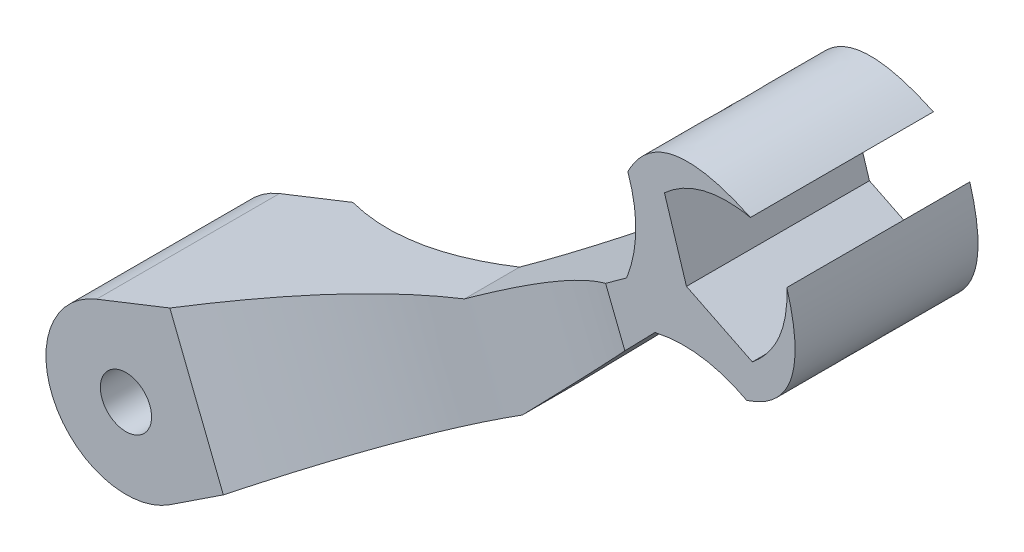
ISO-10303-21;
HEADER;
FILE_DESCRIPTION(('STEP AP214'),'2;1');
FILE_NAME('part.step','',(''),(''),'','','');
FILE_SCHEMA(('AUTOMOTIVE_DESIGN { 1 0 10303 214 1 1 1 1 }'));
ENDSEC;
DATA;
#1=APPLICATION_CONTEXT('core data for automotive mechanical design processes');
#2=APPLICATION_PROTOCOL_DEFINITION('international standard','automotive_design',2000,#1);
#3=PRODUCT_CONTEXT('',#1,'mechanical');
#4=PRODUCT('Part','Part','',(#3));
#5=PRODUCT_RELATED_PRODUCT_CATEGORY('part','',(#4));
#6=PRODUCT_DEFINITION_FORMATION('','',#4);
#7=PRODUCT_DEFINITION_CONTEXT('part definition',#1,'design');
#8=PRODUCT_DEFINITION('design','',#6,#7);
#9=PRODUCT_DEFINITION_SHAPE('','',#8);
#10=(LENGTH_UNIT() NAMED_UNIT(*) SI_UNIT(.MILLI.,.METRE.));
#11=(NAMED_UNIT(*) PLANE_ANGLE_UNIT() SI_UNIT($,.RADIAN.));
#12=(NAMED_UNIT(*) SI_UNIT($,.STERADIAN.) SOLID_ANGLE_UNIT());
#13=UNCERTAINTY_MEASURE_WITH_UNIT(LENGTH_MEASURE(1.E-05),#10,'distance_accuracy_value','');
#14=(GEOMETRIC_REPRESENTATION_CONTEXT(3) GLOBAL_UNCERTAINTY_ASSIGNED_CONTEXT((#13)) GLOBAL_UNIT_ASSIGNED_CONTEXT((#10,
#11,#12)) REPRESENTATION_CONTEXT('',''));
#15=CARTESIAN_POINT('',(0.,0.,0.));
#16=DIRECTION('',(0.,0.,1.));
#17=DIRECTION('',(1.,0.,0.));
#18=AXIS2_PLACEMENT_3D('',#15,#16,#17);
#19=CARTESIAN_POINT('',(0.,0.,20.32));
#20=DIRECTION('',(0.,0.,1.));
#21=DIRECTION('',(1.,0.,0.));
#22=AXIS2_PLACEMENT_3D('',#19,#20,#21);
#23=PLANE('',#22);
#24=DIRECTION('',(-0.810919763460068,-0.585157361083211,0.));
#25=VECTOR('',#24,1.);
#26=CARTESIAN_POINT('',(60.9907873534478,43.2497564408883,20.32));
#27=LINE('',#26,#25);
#28=CARTESIAN_POINT('',(111.21965607316,79.4947631537742,20.32));
#29=VERTEX_POINT('',#28);
#30=CARTESIAN_POINT('',(106.54054712,76.1183316365923,20.32));
#31=VERTEX_POINT('',#30);
#32=EDGE_CURVE('E371',#29,#31,#27,.T.);
#33=ORIENTED_EDGE('',*,*,#32,.T.);
#34=DIRECTION('',(0.367873620684487,-0.929875797730259,0.));
#35=VECTOR('',#34,1.);
#36=CARTESIAN_POINT('',(80.3174624117796,142.402540236909,20.32));
#37=LINE('',#36,#35);
#38=CARTESIAN_POINT('',(110.824263645709,65.2903621991998,20.32));
#39=VERTEX_POINT('',#38);
#40=EDGE_CURVE('E258',#31,#39,#37,.T.);
#41=ORIENTED_EDGE('',*,*,#40,.T.);
#42=DIRECTION('',(0.69778723962863,0.716305080403216,0.));
#43=VECTOR('',#42,1.);
#44=CARTESIAN_POINT('',(74.0328425107888,27.5225722805653,20.32));
#45=LINE('',#44,#43);
#46=CARTESIAN_POINT('',(117.511141846048,72.1546964187383,20.32));
#47=VERTEX_POINT('',#46);
#48=EDGE_CURVE('E205',#39,#47,#45,.T.);
#49=ORIENTED_EDGE('',*,*,#48,.T.);
#50=CARTESIAN_POINT('',(117.511141846048,72.1546964187383,20.32));
#51=CARTESIAN_POINT('',(128.03696367341,74.4965693206494,20.32));
#52=CARTESIAN_POINT('',(137.894611709155,69.2688063883033,20.32));
#53=B_SPLINE_CURVE_WITH_KNOTS('',2,(#50,#51,#52),.UNSPECIFIED.,.F.,.F.,(3,3),(0.,1.),.UNSPECIFIED.);
#54=CARTESIAN_POINT('',(137.894611709155,69.2688063883033,20.32));
#55=VERTEX_POINT('',#54);
#56=EDGE_CURVE('E208',#47,#55,#53,.T.);
#57=ORIENTED_EDGE('',*,*,#56,.T.);
#58=CARTESIAN_POINT('',(137.894611709155,69.2688063883033,20.32));
#59=CARTESIAN_POINT('',(153.056423627428,74.1893946725533,20.32));
#60=CARTESIAN_POINT('',(146.802069803913,95.4454043846387,20.32));
#61=B_SPLINE_CURVE_WITH_KNOTS('',2,(#58,#59,#60),.UNSPECIFIED.,.F.,.F.,(3,3),(0.,1.),.UNSPECIFIED.);
#62=CARTESIAN_POINT('',(146.802069803913,95.4454043846387,20.32));
#63=VERTEX_POINT('',#62);
#64=EDGE_CURVE('E214',#55,#63,#61,.T.);
#65=ORIENTED_EDGE('',*,*,#64,.T.);
#66=CARTESIAN_POINT('',(146.802069803913,95.4454043846387,20.32));
#67=CARTESIAN_POINT('',(147.308308441574,83.9811498959264,20.32));
#68=CARTESIAN_POINT('',(139.137891823467,77.3023086653942,20.32));
#69=B_SPLINE_CURVE_WITH_KNOTS('',2,(#66,#67,#68),.UNSPECIFIED.,.F.,.F.,(3,3),(0.,1.),.UNSPECIFIED.);
#70=CARTESIAN_POINT('',(139.137891823467,77.3023086653942,20.32));
#71=VERTEX_POINT('',#70);
#72=EDGE_CURVE('E415',#63,#71,#69,.T.);
#73=ORIENTED_EDGE('',*,*,#72,.T.);
#74=CARTESIAN_POINT('',(139.137891823467,77.3023086653942,20.32));
#75=CARTESIAN_POINT('',(124.506668385523,84.5172464370435,20.32));
#76=B_SPLINE_CURVE_WITH_KNOTS('',1,(#74,#75),.UNSPECIFIED.,.F.,.F.,(2,2),(0.,1.),.UNSPECIFIED.);
#77=CARTESIAN_POINT('',(124.506668385523,84.5172464370435,20.32));
#78=VERTEX_POINT('',#77);
#79=EDGE_CURVE('E421',#71,#78,#76,.T.);
#80=ORIENTED_EDGE('',*,*,#79,.T.);
#81=CARTESIAN_POINT('',(124.506668385523,84.5172464370435,20.32));
#82=CARTESIAN_POINT('',(119.61432876052,100.079798905499,20.32));
#83=B_SPLINE_CURVE_WITH_KNOTS('',1,(#81,#82),.UNSPECIFIED.,.F.,.F.,(2,2),(0.,1.),.UNSPECIFIED.);
#84=CARTESIAN_POINT('',(119.61432876052,100.079798905499,20.32));
#85=VERTEX_POINT('',#84);
#86=EDGE_CURVE('E428',#78,#85,#83,.T.);
#87=ORIENTED_EDGE('',*,*,#86,.T.);
#88=CARTESIAN_POINT('',(119.61432876052,100.079798905499,20.32));
#89=CARTESIAN_POINT('',(127.464188518168,107.1326231399,20.32));
#90=CARTESIAN_POINT('',(138.716144691841,104.878983682056,20.32));
#91=B_SPLINE_CURVE_WITH_KNOTS('',2,(#88,#89,#90),.UNSPECIFIED.,.F.,.F.,(3,3),(0.,1.),.UNSPECIFIED.);
#92=CARTESIAN_POINT('',(138.716144691841,104.878983682056,20.32));
#93=VERTEX_POINT('',#92);
#94=EDGE_CURVE('E389',#85,#93,#91,.T.);
#95=ORIENTED_EDGE('',*,*,#94,.T.);
#96=CARTESIAN_POINT('',(138.716144691841,104.878983682056,20.32));
#97=CARTESIAN_POINT('',(118.666753914083,114.31067600479,20.32));
#98=CARTESIAN_POINT('',(111.485189551559,100.079798905499,20.32));
#99=B_SPLINE_CURVE_WITH_KNOTS('',2,(#96,#97,#98),.UNSPECIFIED.,.F.,.F.,(3,3),(0.,1.),.UNSPECIFIED.);
#100=CARTESIAN_POINT('',(111.485189551559,100.079798905499,20.32));
#101=VERTEX_POINT('',#100);
#102=EDGE_CURVE('E380',#93,#101,#99,.T.);
#103=ORIENTED_EDGE('',*,*,#102,.T.);
#104=CARTESIAN_POINT('',(111.485189551559,100.079798905499,20.32));
#105=CARTESIAN_POINT('',(115.143809102763,89.5385829864038,20.32));
#106=CARTESIAN_POINT('',(111.21965607316,79.4947631537742,20.32));
#107=B_SPLINE_CURVE_WITH_KNOTS('',2,(#104,#105,#106),.UNSPECIFIED.,.F.,.F.,(3,3),(0.,1.),.UNSPECIFIED.);
#108=EDGE_CURVE('E374',#101,#29,#107,.T.);
#109=ORIENTED_EDGE('',*,*,#108,.T.);
#110=EDGE_LOOP('',(#33,#41,#49,#57,#65,#73,#80,#87,#95,#103,#109));
#111=FACE_BOUND('',#110,.T.);
#112=ADVANCED_FACE('F43',(#111),#23,.T.);
#113=DIRECTION('',(0.834822778271186,0.550518781586586,0.));
#114=VECTOR('',#113,1.);
#115=CARTESIAN_POINT('',(9.78822393660949,-14.8431489976617,20.32));
#116=LINE('',#115,#114);
#117=CARTESIAN_POINT('',(9.78822393660949,-14.8431489976617,20.32));
#118=VERTEX_POINT('',#117);
#119=CARTESIAN_POINT('',(21.6261436223229,-7.03670517326739,20.32));
#120=VERTEX_POINT('',#119);
#121=EDGE_CURVE('E195',#118,#120,#116,.T.);
#122=ORIENTED_EDGE('',*,*,#121,.T.);
#123=DIRECTION('',(0.367873620684487,-0.929875797730259,0.));
#124=VECTOR('',#123,1.);
#125=CARTESIAN_POINT('',(-21.5507968200842,102.101840457516,20.32));
#126=LINE('',#125,#124);
#127=CARTESIAN_POINT('',(9.75156956395877,22.9787088286477,20.32));
#128=VERTEX_POINT('',#127);
#129=EDGE_CURVE('E282',#128,#120,#126,.T.);
#130=ORIENTED_EDGE('',*,*,#129,.F.);
#131=DIRECTION('',(-0.929875797730259,-0.367873620684486,0.));
#132=VECTOR('',#131,1.);
#133=CARTESIAN_POINT('',(-6.54079297577017,16.533191683644,20.32));
#134=LINE('',#133,#132);
#135=CARTESIAN_POINT('',(-6.54079297577017,16.533191683644,20.32));
#136=VERTEX_POINT('',#135);
#137=EDGE_CURVE('E368',#128,#136,#134,.T.);
#138=ORIENTED_EDGE('',*,*,#137,.T.);
#139=CARTESIAN_POINT('',(0.,0.,20.32));
#140=DIRECTION('',(0.,0.,1.));
#141=DIRECTION('',(1.,0.,0.));
#142=AXIS2_PLACEMENT_3D('',#139,#140,#141);
#143=CIRCLE('',#142,17.78);
#144=EDGE_CURVE('E189',#136,#118,#143,.T.);
#145=ORIENTED_EDGE('',*,*,#144,.T.);
#146=EDGE_LOOP('',(#122,#130,#138,#145));
#147=FACE_BOUND('',#146,.T.);
#148=CARTESIAN_POINT('',(0.,0.,20.32));
#149=DIRECTION('',(0.,0.,1.));
#150=DIRECTION('',(1.,0.,0.));
#151=AXIS2_PLACEMENT_3D('',#148,#149,#150);
#152=CIRCLE('',#151,5.69013005613397);
#153=CARTESIAN_POINT('',(5.69013005613397,0.,20.32));
#154=VERTEX_POINT('',#153);
#155=EDGE_CURVE('E564',#154,#154,#152,.T.);
#156=ORIENTED_EDGE('',*,*,#155,.F.);
#157=EDGE_LOOP('',(#156));
#158=FACE_BOUND('',#157,.T.);
#159=ADVANCED_FACE('F551',(#147,#158),#23,.T.);
#160=CARTESIAN_POINT('',(9.78822393660949,-14.8431489976617,20.32));
#161=DIRECTION('',(-0.550518781586586,0.834822778271186,0.));
#162=DIRECTION('',(-0.834822778271186,-0.550518781586586,0.));
#163=AXIS2_PLACEMENT_3D('',#160,#161,#162);
#164=PLANE('',#163);
#165=CARTESIAN_POINT('',(74.0328425107888,27.5225722805653,-6.31627004977947));
#166=CARTESIAN_POINT('',(73.464788712993,27.1479726735854,-6.27579137342487));
#167=CARTESIAN_POINT('',(72.8964351492953,26.7731753878128,-6.24161365913269));
#168=CARTESIAN_POINT('',(71.7592970210883,26.023296595415,-6.18588283049014));
#169=CARTESIAN_POINT('',(71.1905124567089,25.6482150888756,-6.16432971233445));
#170=CARTESIAN_POINT('',(69.4845804903926,24.5232486744338,-6.11866307716634));
#171=CARTESIAN_POINT('',(68.3470396233367,23.7731042983622,-6.11348417250185));
#172=CARTESIAN_POINT('',(66.0731069181015,22.2735732662929,-6.1535686233571));
#173=CARTESIAN_POINT('',(64.9367147948052,21.5241864222765,-6.19880986202309));
#174=CARTESIAN_POINT('',(62.6663336723458,20.0269974597737,-6.33932979763939));
#175=CARTESIAN_POINT('',(61.5323442034024,19.2791950314936,-6.43459758676275));
#176=CARTESIAN_POINT('',(59.2680597372363,17.7860264717417,-6.67454703559294));
#177=CARTESIAN_POINT('',(58.1377646177394,17.040660259637,-6.81922704280519));
#178=CARTESIAN_POINT('',(55.9053630154764,15.5685166597285,-7.15367869291013));
#179=CARTESIAN_POINT('',(54.8031534922309,14.84167132251,-7.34246566157905));
#180=CARTESIAN_POINT('',(52.6047808911212,13.3919679395447,-7.76562500244627));
#181=CARTESIAN_POINT('',(51.5086182281109,12.6691101673708,-8.00000046327809));
#182=CARTESIAN_POINT('',(49.3235242035605,11.2281632606048,-8.51314779221155));
#183=CARTESIAN_POINT('',(48.2345931245149,10.510074312302,-8.79192138417765));
#184=CARTESIAN_POINT('',(46.0651174648114,9.07942684082909,-9.39249795540599));
#185=CARTESIAN_POINT('',(44.9845723610929,8.36686797272971,-9.71429822775677));
#186=CARTESIAN_POINT('',(42.8329804016233,6.94801379813279,-10.3994012788384));
#187=CARTESIAN_POINT('',(41.7619312479956,6.24171697631453,-10.762693704387));
#188=CARTESIAN_POINT('',(39.8798646612682,5.00059966236715,-11.4394041132547));
#189=CARTESIAN_POINT('',(39.0667625130823,4.46440441760908,-11.7445423688031));
#190=CARTESIAN_POINT('',(37.4469115303607,3.39620358197009,-12.3774830062166));
#191=CARTESIAN_POINT('',(36.6401614259768,2.86419715369556,-12.705280723095));
#192=CARTESIAN_POINT('',(35.0331951579745,1.8044930644715,-13.382830813308));
#193=CARTESIAN_POINT('',(34.2329784440151,1.27679504060299,-13.7325813154281));
#194=CARTESIAN_POINT('',(32.6392464746479,0.225818228771651,-14.4533183608676));
#195=CARTESIAN_POINT('',(31.8457311845882,-0.297460582042149,-14.8243047943025));
#196=CARTESIAN_POINT('',(30.2553126918304,-1.34625234196386,-15.5917324032316));
#197=CARTESIAN_POINT('',(29.4584998133237,-1.87170572733559,-15.9884420345067));
#198=CARTESIAN_POINT('',(27.8720948971838,-2.91785075867371,-16.8021315085068));
#199=CARTESIAN_POINT('',(27.082503082907,-3.43854225734915,-17.2191119757308));
#200=CARTESIAN_POINT('',(25.5107105580175,-4.47505123653749,-18.0725613676065));
#201=CARTESIAN_POINT('',(24.7285097630582,-4.99086877267234,-18.5090300695311));
#202=CARTESIAN_POINT('',(23.1716585483231,-6.01752479614893,-19.4006689038387));
#203=CARTESIAN_POINT('',(22.3970074424934,-6.52836373590476,-19.8558373169659));
#204=CARTESIAN_POINT('',(21.6261436223229,-7.03670517326739,-20.32));
#205=B_SPLINE_CURVE_WITH_KNOTS('',3,(#165,#166,#167,#168,#169,#170,#171,#172,#173,#174,#175,
#176,#177,#178,#179,#180,#181,#182,#183,#184,#185,#186,#187,#188,#189,#190,#191,#192,#193,#194,
#195,#196,#197,#198,#199,#200,#201,#202,#203,#204),.UNSPECIFIED.,.F.,.F.,(4,2,2,2,2,2,2,2,2,2,2,
2,2,2,2,2,2,2,2,4),(0.,2.04489311288249,4.08978560938914,8.17663779514646,12.2616979838545,
16.3458678325626,20.4299011076036,24.4302522094485,28.4308744306989,32.4316520236369,
36.4321780364065,40.4317080040296,43.4934230991737,46.5545097342992,49.6153358015215,
52.6761460320427,55.776793441694,58.8775364359552,61.9782440015176,65.0786671225137),.UNSPECIFIED.);
#206=CARTESIAN_POINT('',(74.0328425107888,27.5225722805653,-6.31627004977947));
#207=VERTEX_POINT('',#206);
#208=CARTESIAN_POINT('',(21.6261436223229,-7.0367051732674,-20.32));
#209=VERTEX_POINT('',#208);
#210=EDGE_CURVE('E68',#207,#209,#205,.T.);
#211=ORIENTED_EDGE('',*,*,#210,.F.);
#212=DIRECTION('',(0.,0.,-1.));
#213=VECTOR('',#212,1.);
#214=CARTESIAN_POINT('',(74.0328425107888,27.5225722805653,20.32));
#215=LINE('',#214,#213);
#216=CARTESIAN_POINT('',(74.0328425107888,27.5225722805653,6.31627004977947));
#217=VERTEX_POINT('',#216);
#218=EDGE_CURVE('E325',#217,#207,#215,.T.);
#219=ORIENTED_EDGE('',*,*,#218,.F.);
#220=CARTESIAN_POINT('',(21.6261436223229,-7.03670517326738,20.32));
#221=CARTESIAN_POINT('',(22.7016047118696,-6.32749892725773,19.6724267241037));
#222=CARTESIAN_POINT('',(23.7844583014621,-5.61341774225026,19.0423517389828));
#223=CARTESIAN_POINT('',(25.9663883066049,-4.17455732875513,17.8182753213257));
#224=CARTESIAN_POINT('',(27.0654878998585,-3.44976281587264,17.2243331994239));
#225=CARTESIAN_POINT('',(29.2790032520006,-1.99007363823905,16.0751143434593));
#226=CARTESIAN_POINT('',(30.3934331279267,-1.25516966409374,15.5198765650617));
#227=CARTESIAN_POINT('',(32.6366317169495,0.224093942779767,14.4505626744991));
#228=CARTESIAN_POINT('',(33.7654073260428,0.968458123030789,13.9365072983351));
#229=CARTESIAN_POINT('',(36.0362863977038,2.46597545509281,12.9519279326316));
#230=CARTESIAN_POINT('',(37.1783914641822,3.21912966459295,12.4814092438907));
#231=CARTESIAN_POINT('',(39.4479164372536,4.71575404461169,11.5966438796712));
#232=CARTESIAN_POINT('',(40.5750463669366,5.45903299162825,11.181330862957));
#233=CARTESIAN_POINT('',(42.8398986040434,6.95257596445868,10.3963105167314));
#234=CARTESIAN_POINT('',(43.9776169768492,7.70283739561271,10.0265869212065));
#235=CARTESIAN_POINT('',(46.2625520937677,9.20962390085795,9.33452729860997));
#236=CARTESIAN_POINT('',(47.409764572571,9.96614616221692,9.01217109517044));
#237=CARTESIAN_POINT('',(49.7125510715025,11.4847046522848,8.41645411478338));
#238=CARTESIAN_POINT('',(50.8681215909708,12.246738572505,8.14307393579164));
#239=CARTESIAN_POINT('',(53.1864855978138,13.7755695550094,7.64672790442334));
#240=CARTESIAN_POINT('',(54.3492769858802,14.5423652329177,7.42374804510945));
#241=CARTESIAN_POINT('',(56.2762583429229,15.813101317786,7.09784868151037));
#242=CARTESIAN_POINT('',(57.0387238616534,16.3159045465653,6.98011944534536));
#243=CARTESIAN_POINT('',(58.5658064433415,17.3229298268218,6.76697203209185));
#244=CARTESIAN_POINT('',(59.3304234242325,17.8271518241806,6.67155301535778));
#245=CARTESIAN_POINT('',(60.861355548438,18.8367156617351,6.50328724778732));
#246=CARTESIAN_POINT('',(61.6276706249405,19.3420574578721,6.43043962421384));
#247=CARTESIAN_POINT('',(63.1615549746224,20.3535681224832,6.30752175944877));
#248=CARTESIAN_POINT('',(63.9291242159191,20.8597369699325,6.25745094800458));
#249=CARTESIAN_POINT('',(65.4746878796197,21.8789494868299,6.17975671740535));
#250=CARTESIAN_POINT('',(66.2526924466572,22.3919998460944,6.15242235479869));
#251=CARTESIAN_POINT('',(67.8090513114527,23.4183311924108,6.12136486212499));
#252=CARTESIAN_POINT('',(68.5874056181004,23.931612185325,6.11764237066154));
#253=CARTESIAN_POINT('',(70.1439966834058,24.9580966548493,6.1338574599705));
#254=CARTESIAN_POINT('',(70.9222334301133,25.471300123579,6.1537966873263));
#255=CARTESIAN_POINT('',(72.478123202615,26.4973221298477,6.21731099244684));
#256=CARTESIAN_POINT('',(73.2557761518552,27.0101406169038,6.26088876120307));
#257=CARTESIAN_POINT('',(74.0328425107888,27.5225722805653,6.31627004977947));
#258=B_SPLINE_CURVE_WITH_KNOTS('',3,(#220,#221,#222,#223,#224,#225,#226,#227,#228,#229,#230,
#231,#232,#233,#234,#235,#236,#237,#238,#239,#240,#241,#242,#243,#244,#245,#246,#247,#248,#249,
#250,#251,#252,#253,#254,#255,#256,#257),.UNSPECIFIED.,.F.,.F.,(4,2,2,2,2,2,2,2,2,2,2,2,2,2,2,2,
2,2,4),(0.,4.3255053067796,8.657929146069,12.9946523942326,17.3335457045635,21.6729666025359,
25.9099285200627,30.1453743154012,34.3790107397142,38.6109662656427,42.8417442232653,
45.6041460500694,48.3664438970838,51.1286349247851,53.8907567929696,56.6874798394778,
59.4842785254716,62.2812718478876,65.0785836444929),.UNSPECIFIED.);
#259=EDGE_CURVE('E257',#120,#217,#258,.T.);
#260=ORIENTED_EDGE('',*,*,#259,.F.);
#261=ORIENTED_EDGE('',*,*,#121,.F.);
#262=DIRECTION('',(0.,0.,-1.));
#263=VECTOR('',#262,1.);
#264=CARTESIAN_POINT('',(9.78822393660949,-14.8431489976617,20.32));
#265=LINE('',#264,#263);
#266=CARTESIAN_POINT('',(9.78822393660949,-14.8431489976617,-20.32));
#267=VERTEX_POINT('',#266);
#268=EDGE_CURVE('E171',#118,#267,#265,.T.);
#269=ORIENTED_EDGE('',*,*,#268,.T.);
#270=DIRECTION('',(0.834822778271186,0.550518781586586,0.));
#271=VECTOR('',#270,1.);
#272=CARTESIAN_POINT('',(9.78822393660949,-14.8431489976617,-20.32));
#273=LINE('',#272,#271);
#274=EDGE_CURVE('E326',#267,#209,#273,.T.);
#275=ORIENTED_EDGE('',*,*,#274,.T.);
#276=EDGE_LOOP('',(#211,#219,#260,#261,#269,#275));
#277=FACE_BOUND('',#276,.T.);
#278=ADVANCED_FACE('F234',(#277),#164,.F.);
#279=CARTESIAN_POINT('',(74.0328425107888,27.5225722805653,20.32));
#280=DIRECTION('',(-0.716305080403216,0.69778723962863,0.));
#281=DIRECTION('',(-0.69778723962863,-0.716305080403216,0.));
#282=AXIS2_PLACEMENT_3D('',#279,#280,#281);
#283=PLANE('',#282);
#284=CARTESIAN_POINT('',(110.824263645709,65.2903621991998,-20.32));
#285=CARTESIAN_POINT('',(109.855109947338,64.2954891513567,-19.6567688575766));
#286=CARTESIAN_POINT('',(108.879555603166,63.2940455977151,-19.0126346604953));
#287=CARTESIAN_POINT('',(106.920807073218,61.2833159031153,-17.7675504951341));
#288=CARTESIAN_POINT('',(105.937673200466,60.2740916757657,-17.1664055614093));
#289=CARTESIAN_POINT('',(103.963523150326,58.2475517362472,-16.0081660408604));
#290=CARTESIAN_POINT('',(102.972555569712,57.2302859105119,-15.4509015600156));
#291=CARTESIAN_POINT('',(100.982511103267,55.1874297495114,-14.3813312543488));
#292=CARTESIAN_POINT('',(99.9834706698624,54.1618768340452,-13.8688862530581));
#293=CARTESIAN_POINT('',(97.9770340968977,52.1021935536712,-12.8899044580714));
#294=CARTESIAN_POINT('',(96.9696622739986,51.0680881507383,-12.4232654138958));
#295=CARTESIAN_POINT('',(94.946305050531,48.9910351805352,-11.5368902076615));
#296=CARTESIAN_POINT('',(93.930332163443,47.9481004588279,-11.1170954385439));
#297=CARTESIAN_POINT('',(91.8885632299315,45.8521471695959,-10.3250884628026));
#298=CARTESIAN_POINT('',(90.8627603514055,44.7991215886587,-9.95291238975417));
#299=CARTESIAN_POINT('',(88.8021059336218,42.6837816331741,-9.2577403934746));
#300=CARTESIAN_POINT('',(87.7672471896722,41.6214598627368,-8.93478828659887));
#301=CARTESIAN_POINT('',(85.6883461010839,39.4873890072651,-8.33924603155457));
#302=CARTESIAN_POINT('',(84.6442895790515,38.4156253685978,-8.06675738436583));
#303=CARTESIAN_POINT('',(82.5468633804536,36.2625377847291,-7.57335248787366));
#304=CARTESIAN_POINT('',(81.4934746795601,35.1811943103329,-7.35260232781559));
#305=CARTESIAN_POINT('',(79.3772072685572,33.0087655069631,-6.9639113831327));
#306=CARTESIAN_POINT('',(78.3143071933027,31.9176582458573,-6.79620795251453));
#307=CARTESIAN_POINT('',(76.7143188613856,30.2752095084054,-6.5854165741498));
#308=CARTESIAN_POINT('',(76.1785115662162,29.7251829876407,-6.52182402843506));
#309=CARTESIAN_POINT('',(75.1061780509243,28.6243919423659,-6.40857802737256));
#310=CARTESIAN_POINT('',(74.5696518278043,28.0736274147787,-6.35892463032467));
#311=CARTESIAN_POINT('',(74.0328425107888,27.5225722805653,-6.31627004977947));
#312=B_SPLINE_CURVE_WITH_KNOTS('',3,(#284,#285,#286,#287,#288,#289,#290,#291,#292,#293,#294,
#295,#296,#297,#298,#299,#300,#301,#302,#303,#304,#305,#306,#307,#308,#309,#310,#311),
.UNSPECIFIED.,.F.,.F.,(4,2,2,2,2,2,2,2,2,2,2,2,2,4),(0.,4.6173013194813,9.21212449783964,
13.788180195597,18.3494802486354,22.9003550281693,27.4454707971501,31.9940152484587,
36.5465852004166,41.1082149216625,45.6842935863194,50.2805670893811,52.5919424067527,
54.9033273912043),.UNSPECIFIED.);
#313=CARTESIAN_POINT('',(110.824263645709,65.2903621991998,-20.32));
#314=VERTEX_POINT('',#313);
#315=EDGE_CURVE('E239',#314,#207,#312,.T.);
#316=ORIENTED_EDGE('',*,*,#315,.F.);
#317=DIRECTION('',(0.69778723962863,0.716305080403216,0.));
#318=VECTOR('',#317,1.);
#319=CARTESIAN_POINT('',(74.0328425107888,27.5225722805653,-20.32));
#320=LINE('',#319,#318);
#321=CARTESIAN_POINT('',(117.511141846048,72.1546964187383,-20.32));
#322=VERTEX_POINT('',#321);
#323=EDGE_CURVE('E462',#314,#322,#320,.T.);
#324=ORIENTED_EDGE('',*,*,#323,.T.);
#325=DIRECTION('',(0.,0.,-1.));
#326=VECTOR('',#325,1.);
#327=CARTESIAN_POINT('',(117.511141846048,72.1546964187383,20.32));
#328=LINE('',#327,#326);
#329=EDGE_CURVE('E330',#47,#322,#328,.T.);
#330=ORIENTED_EDGE('',*,*,#329,.F.);
#331=ORIENTED_EDGE('',*,*,#48,.F.);
#332=CARTESIAN_POINT('',(74.0328425107888,27.5225722805653,6.31627004977947));
#333=CARTESIAN_POINT('',(74.5696518278043,28.0736274147787,6.35892463032467));
#334=CARTESIAN_POINT('',(75.1061780509243,28.6243919423659,6.40857802737256));
#335=CARTESIAN_POINT('',(76.1785115662162,29.7251829876407,6.52182402843506));
#336=CARTESIAN_POINT('',(76.7143188613856,30.2752095084054,6.5854165741498));
#337=CARTESIAN_POINT('',(78.3143071933027,31.9176582458573,6.79620795251453));
#338=CARTESIAN_POINT('',(79.3772072685572,33.0087655069631,6.9639113831327));
#339=CARTESIAN_POINT('',(81.4934746795601,35.1811943103329,7.35260232781559));
#340=CARTESIAN_POINT('',(82.5468633804536,36.2625377847291,7.57335248787366));
#341=CARTESIAN_POINT('',(84.6442895790515,38.4156253685978,8.06675738436584));
#342=CARTESIAN_POINT('',(85.6883461010839,39.4873890072651,8.33924603155457));
#343=CARTESIAN_POINT('',(87.7672471896722,41.6214598627368,8.93478828659887));
#344=CARTESIAN_POINT('',(88.8021059336218,42.6837816331741,9.2577403934746));
#345=CARTESIAN_POINT('',(90.8627603514055,44.7991215886587,9.95291238975418));
#346=CARTESIAN_POINT('',(91.8885632299315,45.8521471695959,10.3250884628026));
#347=CARTESIAN_POINT('',(93.930332163443,47.9481004588279,11.1170954385439));
#348=CARTESIAN_POINT('',(94.946305050531,48.9910351805352,11.5368902076615));
#349=CARTESIAN_POINT('',(96.9696622739986,51.0680881507383,12.4232654138958));
#350=CARTESIAN_POINT('',(97.9770340968977,52.1021935536713,12.8899044580714));
#351=CARTESIAN_POINT('',(99.9834706698624,54.1618768340453,13.8688862530581));
#352=CARTESIAN_POINT('',(100.982511103267,55.1874297495114,14.3813312543488));
#353=CARTESIAN_POINT('',(102.972555569712,57.2302859105119,15.4509015600156));
#354=CARTESIAN_POINT('',(103.963523150326,58.2475517362472,16.0081660408604));
#355=CARTESIAN_POINT('',(105.937673200466,60.2740916757657,17.1664055614093));
#356=CARTESIAN_POINT('',(106.920807073218,61.2833159031153,17.7675504951341));
#357=CARTESIAN_POINT('',(108.879555603166,63.2940455977151,19.0126346604953));
#358=CARTESIAN_POINT('',(109.855109947338,64.2954891513567,19.6567688575766));
#359=CARTESIAN_POINT('',(110.824263645709,65.2903621991998,20.32));
#360=B_SPLINE_CURVE_WITH_KNOTS('',3,(#332,#333,#334,#335,#336,#337,#338,#339,#340,#341,#342,
#343,#344,#345,#346,#347,#348,#349,#350,#351,#352,#353,#354,#355,#356,#357,#358,#359),
.UNSPECIFIED.,.F.,.F.,(4,2,2,2,2,2,2,2,2,2,2,2,2,4),(0.,2.31138498445157,4.62276030182322,
9.2190338048849,13.7951124695418,18.3567421907877,22.9093121427456,27.4578565940542,
32.0029723630349,36.5538471425689,41.1151471956073,45.6912028933647,50.286026071723,
54.9033273912043),.UNSPECIFIED.);
#361=EDGE_CURVE('E248',#217,#39,#360,.T.);
#362=ORIENTED_EDGE('',*,*,#361,.F.);
#363=ORIENTED_EDGE('',*,*,#218,.T.);
#364=EDGE_LOOP('',(#316,#324,#330,#331,#362,#363));
#365=FACE_BOUND('',#364,.T.);
#366=ADVANCED_FACE('F230',(#365),#283,.F.);
#367=CARTESIAN_POINT('',(60.9907873534478,43.2497564408883,20.32));
#368=DIRECTION('',(0.585157361083211,-0.810919763460068,0.));
#369=DIRECTION('',(0.810919763460068,0.585157361083211,0.));
#370=AXIS2_PLACEMENT_3D('',#367,#368,#369);
#371=PLANE('',#370);
#372=CARTESIAN_POINT('',(60.9907873534478,43.2497564408883,-6.12160390500805));
#373=CARTESIAN_POINT('',(61.565328862565,43.6643439358006,-6.12204824554398));
#374=CARTESIAN_POINT('',(62.1398529984399,44.0789188942314,-6.12919292189698));
#375=CARTESIAN_POINT('',(63.2886880967868,44.9079149857806,-6.1568767397154));
#376=CARTESIAN_POINT('',(63.8629990596013,45.3223361191463,-6.17741585956324));
#377=CARTESIAN_POINT('',(65.5844724288887,46.5645463344321,-6.25907410813826));
#378=CARTESIAN_POINT('',(66.7310514058045,47.3919144152676,-6.34023483745852));
#379=CARTESIAN_POINT('',(69.0203752328939,49.0438838821463,-6.55563280309777));
#380=CARTESIAN_POINT('',(70.1631215720641,49.8684863426451,-6.68984621775485));
#381=CARTESIAN_POINT('',(72.4435297941159,51.5140223346582,-7.01067559341213));
#382=CARTESIAN_POINT('',(73.5811926779128,52.33495658843,-7.19728073092645));
#383=CARTESIAN_POINT('',(75.8501557314598,53.9722337798797,-7.62198800375957));
#384=CARTESIAN_POINT('',(76.9814559841873,54.7885767774337,-7.86008946589135));
#385=CARTESIAN_POINT('',(79.2154967400365,56.4006541396467,-8.38176532407788));
#386=CARTESIAN_POINT('',(80.3183788746748,57.1964907051993,-8.6644188786046));
#387=CARTESIAN_POINT('',(82.5155596299567,58.7819699973769,-9.27693847336189));
#388=CARTESIAN_POINT('',(83.6098576429379,59.5716122855146,-9.60680782470551));
#389=CARTESIAN_POINT('',(85.7887253721089,61.1438769509001,-10.3122800815323));
#390=CARTESIAN_POINT('',(86.8732949300405,61.9264992139494,-10.6878837295572));
#391=CARTESIAN_POINT('',(89.0315950348074,63.4839223409209,-11.4831637308014));
#392=CARTESIAN_POINT('',(90.1053268774375,64.258724139885,-11.9028347450827));
#393=CARTESIAN_POINT('',(92.2409092580724,65.7997542226839,-12.7844377576532));
#394=CARTESIAN_POINT('',(93.3027638475122,66.5659854300224,-13.2463548194496));
#395=CARTESIAN_POINT('',(94.8767478839569,67.7017677683677,-13.9652773903945));
#396=CARTESIAN_POINT('',(95.3935376810189,68.0746817945264,-14.2068872713541));
#397=CARTESIAN_POINT('',(96.4240018390888,68.818261757178,-14.6996273102278));
#398=CARTESIAN_POINT('',(96.9376768443388,69.188928158554,-14.9507554157282));
#399=CARTESIAN_POINT('',(97.9618870656247,69.9279952984704,-15.4623302981547));
#400=CARTESIAN_POINT('',(98.472422677005,70.2963963222901,-15.722775872351));
#401=CARTESIAN_POINT('',(99.4903384761919,71.0309214253849,-16.2527869078626));
#402=CARTESIAN_POINT('',(99.9977188333665,71.3970456268755,-16.5223518745755));
#403=CARTESIAN_POINT('',(101.013094113921,72.129737499057,-17.0724537722001));
#404=CARTESIAN_POINT('',(101.521065122546,72.4962879129292,-17.3530578138229));
#405=CARTESIAN_POINT('',(102.533767455643,73.2270509939395,-17.9231143614056));
#406=CARTESIAN_POINT('',(103.038498585795,73.5912635208555,-18.2125673922207));
#407=CARTESIAN_POINT('',(104.044702062047,74.317337045521,-18.8001158272461));
#408=CARTESIAN_POINT('',(104.54617408159,74.6791978076279,-19.0982120816339));
#409=CARTESIAN_POINT('',(105.545841940752,75.4005552498623,-19.7028410240981));
#410=CARTESIAN_POINT('',(106.044037355459,75.7600516233749,-20.0093747806318));
#411=CARTESIAN_POINT('',(106.54054712,76.1183316365924,-20.32));
#412=B_SPLINE_CURVE_WITH_KNOTS('',3,(#372,#373,#374,#375,#376,#377,#378,#379,#380,#381,#382,
#383,#384,#385,#386,#387,#388,#389,#390,#391,#392,#393,#394,#395,#396,#397,#398,#399,#400,#401,
#402,#403,#404,#405,#406,#407,#408,#409,#410,#411),.UNSPECIFIED.,.F.,.F.,(4,2,2,2,2,2,2,2,2,2,2,
2,2,2,2,2,2,2,2,4),(0.,2.12545229832142,4.2509011663404,8.49855990616138,12.7443135292511,
16.9891906764135,21.2340123356641,25.4004532356733,29.5671864599227,33.7339873442387,
37.9002839851127,42.0651132449229,44.1097042317083,46.1538568241653,48.1977464960305,
50.2415254919894,52.3006281138148,54.3598531039246,56.4192813383743,58.4789715730062),.UNSPECIFIED.);
#413=CARTESIAN_POINT('',(60.9907873534478,43.2497564408883,-6.12160390500805));
#414=VERTEX_POINT('',#413);
#415=CARTESIAN_POINT('',(106.54054712,76.1183316365924,-20.32));
#416=VERTEX_POINT('',#415);
#417=EDGE_CURVE('E283',#414,#416,#412,.T.);
#418=ORIENTED_EDGE('',*,*,#417,.F.);
#419=DIRECTION('',(0.,0.,-1.));
#420=VECTOR('',#419,1.);
#421=CARTESIAN_POINT('',(60.9907873534478,43.2497564408883,20.32));
#422=LINE('',#421,#420);
#423=CARTESIAN_POINT('',(60.9907873534478,43.2497564408883,6.12160390500805));
#424=VERTEX_POINT('',#423);
#425=EDGE_CURVE('E180',#424,#414,#422,.T.);
#426=ORIENTED_EDGE('',*,*,#425,.F.);
#427=CARTESIAN_POINT('',(106.54054712,76.1183316365923,20.32));
#428=CARTESIAN_POINT('',(105.517745979209,75.3802812850949,19.680111112973));
#429=CARTESIAN_POINT('',(104.487760777624,74.6370469360605,19.0575768514863));
#430=CARTESIAN_POINT('',(102.412232353359,73.1393516148689,17.8482431980585));
#431=CARTESIAN_POINT('',(101.366668408296,72.3848756894996,17.2614979149631));
#432=CARTESIAN_POINT('',(99.260846068749,70.8653203664652,16.1261464411742));
#433=CARTESIAN_POINT('',(98.2005750400695,70.1002318520013,15.5775758358867));
#434=CARTESIAN_POINT('',(96.0662744121923,68.5601266782933,14.5208649989315));
#435=CARTESIAN_POINT('',(94.9922385728484,67.7851055161778,14.0127439158486));
#436=CARTESIAN_POINT('',(92.8313813646285,66.2258371907341,13.0390874321057));
#437=CARTESIAN_POINT('',(91.7445584259668,65.4415888946531,12.5735573229348));
#438=CARTESIAN_POINT('',(89.5815626342559,63.880777373534,11.6961811149564));
#439=CARTESIAN_POINT('',(88.5056325058678,63.1043892979109,11.2834257566845));
#440=CARTESIAN_POINT('',(86.3435749896614,61.5442548336881,10.5024609094465));
#441=CARTESIAN_POINT('',(85.2574511650338,60.7605110162765,10.1342364370721));
#442=CARTESIAN_POINT('',(83.0760808796501,59.18644051355,9.44390151358163));
#443=CARTESIAN_POINT('',(81.9808384230842,58.3961167176472,9.12177184586135));
#444=CARTESIAN_POINT('',(79.7823489997974,56.8096930944138,8.5250113424313));
#445=CARTESIAN_POINT('',(78.6791055430526,56.0135957998719,8.25036085295995));
#446=CARTESIAN_POINT('',(76.4657383290262,54.4164364057766,7.74974667454134));
#447=CARTESIAN_POINT('',(75.3556170435382,53.6153760898625,7.52376643233008));
#448=CARTESIAN_POINT('',(73.5144832201832,52.286819236249,7.19101661695485));
#449=CARTESIAN_POINT('',(72.7851385591864,51.760526233686,7.07004789578366));
#450=CARTESIAN_POINT('',(71.3243676575285,50.7064381666816,6.84959338458012));
#451=CARTESIAN_POINT('',(70.5929415890824,50.17864322651,6.75010586672173));
#452=CARTESIAN_POINT('',(69.1283988319257,49.1218333994628,6.57280706270002));
#453=CARTESIAN_POINT('',(68.3952822212802,48.5928185689189,6.49499479506487));
#454=CARTESIAN_POINT('',(66.9217068696836,47.529490847791,6.36063930226787));
#455=CARTESIAN_POINT('',(66.181237316169,46.9951701548925,6.30427618653749));
#456=CARTESIAN_POINT('',(64.6993695426316,45.9258586460232,6.21383350465315));
#457=CARTESIAN_POINT('',(63.9579712813358,45.39086780027,6.17975496679975));
#458=CARTESIAN_POINT('',(62.4746465838047,44.3205049792514,6.13392236269406));
#459=CARTESIAN_POINT('',(61.732720101939,43.7851329710592,6.12217054258723));
#460=CARTESIAN_POINT('',(60.9907873534478,43.2497564408883,6.12160390500805));
#461=B_SPLINE_CURVE_WITH_KNOTS('',3,(#427,#428,#429,#430,#431,#432,#433,#434,#435,#436,#437,
#438,#439,#440,#441,#442,#443,#444,#445,#446,#447,#448,#449,#450,#451,#452,#453,#454,#455,#456,
#457,#458,#459,#460),.UNSPECIFIED.,.F.,.F.,(4,2,2,2,2,2,2,2,2,2,2,2,2,2,2,2,4),(0.,
4.2428951406761,8.49205369121434,12.7451215564427,17.0001909738043,21.2557883237847,
25.4236067095091,29.5900188149847,33.7546888798659,37.9176308513513,42.0791547186717,
44.8014309387257,47.5234881126996,50.2454220098098,52.9897326482726,55.734169911394,
58.4788832598317),.UNSPECIFIED.);
#462=EDGE_CURVE('E60',#31,#424,#461,.T.);
#463=ORIENTED_EDGE('',*,*,#462,.F.);
#464=ORIENTED_EDGE('',*,*,#32,.F.);
#465=DIRECTION('',(0.,0.,-1.));
#466=VECTOR('',#465,1.);
#467=CARTESIAN_POINT('',(111.21965607316,79.4947631537742,20.32));
#468=LINE('',#467,#466);
#469=CARTESIAN_POINT('',(111.21965607316,79.4947631537742,-20.32));
#470=VERTEX_POINT('',#469);
#471=EDGE_CURVE('E360',#29,#470,#468,.T.);
#472=ORIENTED_EDGE('',*,*,#471,.T.);
#473=DIRECTION('',(-0.810919763460068,-0.585157361083211,0.));
#474=VECTOR('',#473,1.);
#475=CARTESIAN_POINT('',(60.9907873534478,43.2497564408883,-20.32));
#476=LINE('',#475,#474);
#477=EDGE_CURVE('E190',#470,#416,#476,.T.);
#478=ORIENTED_EDGE('',*,*,#477,.T.);
#479=EDGE_LOOP('',(#418,#426,#463,#464,#472,#478));
#480=FACE_BOUND('',#479,.T.);
#481=ADVANCED_FACE('F233',(#480),#371,.F.);
#482=CARTESIAN_POINT('',(-6.54079297577017,16.533191683644,20.32));
#483=DIRECTION('',(0.367873620684487,-0.92987579773026,0.));
#484=DIRECTION('',(0.92987579773026,0.367873620684487,0.));
#485=AXIS2_PLACEMENT_3D('',#482,#483,#484);
#486=PLANE('',#485);
#487=CARTESIAN_POINT('',(9.75156956395877,22.9787088286477,-20.32));
#488=CARTESIAN_POINT('',(64.7272319533718,44.7279532138511,10.042440220173));
#489=CARTESIAN_POINT('',(118.59963504515,66.0407307145894,-24.5233214638745));
#490=B_SPLINE_CURVE_WITH_KNOTS('',2,(#487,#488,#489),.UNSPECIFIED.,.F.,.F.,(3,3),(0.,1.),.UNSPECIFIED.);
#491=CARTESIAN_POINT('',(9.75156956395877,22.9787088286477,-20.32));
#492=VERTEX_POINT('',#491);
#493=EDGE_CURVE('E164',#492,#414,#490,.T.);
#494=ORIENTED_EDGE('',*,*,#493,.F.);
#495=DIRECTION('',(-0.929875797730259,-0.367873620684486,0.));
#496=VECTOR('',#495,1.);
#497=CARTESIAN_POINT('',(-6.54079297577017,16.533191683644,-20.32));
#498=LINE('',#497,#496);
#499=CARTESIAN_POINT('',(-6.54079297577017,16.533191683644,-20.32));
#500=VERTEX_POINT('',#499);
#501=EDGE_CURVE('E177',#492,#500,#498,.T.);
#502=ORIENTED_EDGE('',*,*,#501,.T.);
#503=DIRECTION('',(0.,0.,-1.));
#504=VECTOR('',#503,1.);
#505=CARTESIAN_POINT('',(-6.54079297577017,16.533191683644,20.32));
#506=LINE('',#505,#504);
#507=EDGE_CURVE('E365',#136,#500,#506,.T.);
#508=ORIENTED_EDGE('',*,*,#507,.F.);
#509=ORIENTED_EDGE('',*,*,#137,.F.);
#510=CARTESIAN_POINT('',(118.59963504515,66.0407307145894,24.5233214638745));
#511=CARTESIAN_POINT('',(64.7272319533717,44.7279532138511,-10.042440220173));
#512=CARTESIAN_POINT('',(9.75156956395876,22.9787088286477,20.32));
#513=B_SPLINE_CURVE_WITH_KNOTS('',2,(#510,#511,#512),.UNSPECIFIED.,.F.,.F.,(3,3),(0.,1.),.UNSPECIFIED.);
#514=EDGE_CURVE('E11',#424,#128,#513,.T.);
#515=ORIENTED_EDGE('',*,*,#514,.F.);
#516=ORIENTED_EDGE('',*,*,#425,.T.);
#517=EDGE_LOOP('',(#494,#502,#508,#509,#515,#516));
#518=FACE_BOUND('',#517,.T.);
#519=ADVANCED_FACE('F175',(#518),#486,.F.);
#520=CARTESIAN_POINT('',(0.,0.,-20.32));
#521=DIRECTION('',(0.,0.,1.));
#522=DIRECTION('',(1.,0.,0.));
#523=AXIS2_PLACEMENT_3D('',#520,#521,#522);
#524=PLANE('',#523);
#525=DIRECTION('',(0.367873620684487,-0.929875797730259,0.));
#526=VECTOR('',#525,1.);
#527=CARTESIAN_POINT('',(80.3174624117796,142.402540236909,-20.32));
#528=LINE('',#527,#526);
#529=EDGE_CURVE('E54',#416,#314,#528,.T.);
#530=ORIENTED_EDGE('',*,*,#529,.F.);
#531=ORIENTED_EDGE('',*,*,#477,.F.);
#532=CARTESIAN_POINT('',(111.485189551559,100.079798905499,-20.32));
#533=CARTESIAN_POINT('',(115.143809102763,89.5385829864038,-20.32));
#534=CARTESIAN_POINT('',(111.21965607316,79.4947631537742,-20.32));
#535=B_SPLINE_CURVE_WITH_KNOTS('',2,(#532,#533,#534),.UNSPECIFIED.,.F.,.F.,(3,3),(0.,1.),.UNSPECIFIED.);
#536=CARTESIAN_POINT('',(111.485189551559,100.079798905499,-20.32));
#537=VERTEX_POINT('',#536);
#538=EDGE_CURVE('E198',#537,#470,#535,.T.);
#539=ORIENTED_EDGE('',*,*,#538,.F.);
#540=CARTESIAN_POINT('',(138.716144691841,104.878983682056,-20.32));
#541=CARTESIAN_POINT('',(118.666753914083,114.31067600479,-20.32));
#542=CARTESIAN_POINT('',(111.485189551559,100.079798905499,-20.32));
#543=B_SPLINE_CURVE_WITH_KNOTS('',2,(#540,#541,#542),.UNSPECIFIED.,.F.,.F.,(3,3),(0.,1.),.UNSPECIFIED.);
#544=CARTESIAN_POINT('',(138.716144691841,104.878983682056,-20.32));
#545=VERTEX_POINT('',#544);
#546=EDGE_CURVE('E452',#545,#537,#543,.T.);
#547=ORIENTED_EDGE('',*,*,#546,.F.);
#548=CARTESIAN_POINT('',(119.61432876052,100.079798905499,-20.32));
#549=CARTESIAN_POINT('',(127.464188518168,107.1326231399,-20.32));
#550=CARTESIAN_POINT('',(138.716144691841,104.878983682056,-20.32));
#551=B_SPLINE_CURVE_WITH_KNOTS('',2,(#548,#549,#550),.UNSPECIFIED.,.F.,.F.,(3,3),(0.,1.),.UNSPECIFIED.);
#552=CARTESIAN_POINT('',(119.61432876052,100.079798905499,-20.32));
#553=VERTEX_POINT('',#552);
#554=EDGE_CURVE('E448',#553,#545,#551,.T.);
#555=ORIENTED_EDGE('',*,*,#554,.F.);
#556=CARTESIAN_POINT('',(124.506668385523,84.5172464370435,-20.32));
#557=CARTESIAN_POINT('',(119.61432876052,100.079798905499,-20.32));
#558=B_SPLINE_CURVE_WITH_KNOTS('',1,(#556,#557),.UNSPECIFIED.,.F.,.F.,(2,2),(0.,1.),.UNSPECIFIED.);
#559=CARTESIAN_POINT('',(124.506668385523,84.5172464370435,-20.32));
#560=VERTEX_POINT('',#559);
#561=EDGE_CURVE('E503',#560,#553,#558,.T.);
#562=ORIENTED_EDGE('',*,*,#561,.F.);
#563=CARTESIAN_POINT('',(139.137891823467,77.3023086653942,-20.32));
#564=CARTESIAN_POINT('',(124.506668385523,84.5172464370435,-20.32));
#565=B_SPLINE_CURVE_WITH_KNOTS('',1,(#563,#564),.UNSPECIFIED.,.F.,.F.,(2,2),(0.,1.),.UNSPECIFIED.);
#566=CARTESIAN_POINT('',(139.137891823467,77.3023086653942,-20.32));
#567=VERTEX_POINT('',#566);
#568=EDGE_CURVE('E494',#567,#560,#565,.T.);
#569=ORIENTED_EDGE('',*,*,#568,.F.);
#570=CARTESIAN_POINT('',(146.802069803913,95.4454043846387,-20.32));
#571=CARTESIAN_POINT('',(147.308308441574,83.9811498959264,-20.32));
#572=CARTESIAN_POINT('',(139.137891823467,77.3023086653942,-20.32));
#573=B_SPLINE_CURVE_WITH_KNOTS('',2,(#570,#571,#572),.UNSPECIFIED.,.F.,.F.,(3,3),(0.,1.),.UNSPECIFIED.);
#574=CARTESIAN_POINT('',(146.802069803913,95.4454043846387,-20.32));
#575=VERTEX_POINT('',#574);
#576=EDGE_CURVE('E485',#575,#567,#573,.T.);
#577=ORIENTED_EDGE('',*,*,#576,.F.);
#578=CARTESIAN_POINT('',(137.894611709155,69.2688063883033,-20.32));
#579=CARTESIAN_POINT('',(153.056423627428,74.1893946725533,-20.32));
#580=CARTESIAN_POINT('',(146.802069803913,95.4454043846387,-20.32));
#581=B_SPLINE_CURVE_WITH_KNOTS('',2,(#578,#579,#580),.UNSPECIFIED.,.F.,.F.,(3,3),(0.,1.),.UNSPECIFIED.);
#582=CARTESIAN_POINT('',(137.894611709155,69.2688063883033,-20.32));
#583=VERTEX_POINT('',#582);
#584=EDGE_CURVE('E471',#583,#575,#581,.T.);
#585=ORIENTED_EDGE('',*,*,#584,.F.);
#586=CARTESIAN_POINT('',(117.511141846048,72.1546964187383,-20.32));
#587=CARTESIAN_POINT('',(128.03696367341,74.4965693206494,-20.32));
#588=CARTESIAN_POINT('',(137.894611709155,69.2688063883033,-20.32));
#589=B_SPLINE_CURVE_WITH_KNOTS('',2,(#586,#587,#588),.UNSPECIFIED.,.F.,.F.,(3,3),(0.,1.),.UNSPECIFIED.);
#590=EDGE_CURVE('E465',#322,#583,#589,.T.);
#591=ORIENTED_EDGE('',*,*,#590,.F.);
#592=ORIENTED_EDGE('',*,*,#323,.F.);
#593=EDGE_LOOP('',(#530,#531,#539,#547,#555,#562,#569,#577,#585,#591,#592));
#594=FACE_BOUND('',#593,.T.);
#595=ADVANCED_FACE('F274',(#594),#524,.F.);
#596=DIRECTION('',(-0.367873620684487,0.92987579773026,0.));
#597=VECTOR('',#596,1.);
#598=CARTESIAN_POINT('',(16.2923625397289,6.4455171450037,-20.32));
#599=LINE('',#598,#597);
#600=EDGE_CURVE('E161',#209,#492,#599,.T.);
#601=ORIENTED_EDGE('',*,*,#600,.F.);
#602=ORIENTED_EDGE('',*,*,#274,.F.);
#603=CARTESIAN_POINT('',(0.,0.,-20.32));
#604=DIRECTION('',(0.,0.,1.));
#605=DIRECTION('',(1.,0.,0.));
#606=AXIS2_PLACEMENT_3D('',#603,#604,#605);
#607=CIRCLE('',#606,17.78);
#608=EDGE_CURVE('E187',#500,#267,#607,.T.);
#609=ORIENTED_EDGE('',*,*,#608,.F.);
#610=ORIENTED_EDGE('',*,*,#501,.F.);
#611=EDGE_LOOP('',(#601,#602,#609,#610));
#612=FACE_BOUND('',#611,.T.);
#613=CARTESIAN_POINT('',(0.,0.,-20.32));
#614=DIRECTION('',(0.,0.,1.));
#615=DIRECTION('',(1.,0.,0.));
#616=AXIS2_PLACEMENT_3D('',#613,#614,#615);
#617=CIRCLE('',#616,5.69013005613397);
#618=CARTESIAN_POINT('',(5.69013005613397,0.,-20.32));
#619=VERTEX_POINT('',#618);
#620=EDGE_CURVE('E567',#619,#619,#617,.F.);
#621=ORIENTED_EDGE('',*,*,#620,.F.);
#622=EDGE_LOOP('',(#621));
#623=FACE_BOUND('',#622,.T.);
#624=ADVANCED_FACE('F184',(#612,#623),#524,.F.);
#625=CARTESIAN_POINT('',(0.,0.,20.32));
#626=DIRECTION('',(0.,0.,-1.));
#627=DIRECTION('',(-1.,0.,0.));
#628=AXIS2_PLACEMENT_3D('',#625,#626,#627);
#629=CYLINDRICAL_SURFACE('',#628,17.78);
#630=ORIENTED_EDGE('',*,*,#507,.T.);
#631=ORIENTED_EDGE('',*,*,#608,.T.);
#632=ORIENTED_EDGE('',*,*,#268,.F.);
#633=ORIENTED_EDGE('',*,*,#144,.F.);
#634=EDGE_LOOP('',(#630,#631,#632,#633));
#635=FACE_BOUND('',#634,.T.);
#636=ADVANCED_FACE('F45',(#635),#629,.T.);
#637=DIRECTION('',(0.,0.,-1.));
#638=VECTOR('',#637,1.);
#639=SURFACE_OF_LINEAR_EXTRUSION('',#53,#638);
#640=ORIENTED_EDGE('',*,*,#329,.T.);
#641=ORIENTED_EDGE('',*,*,#590,.T.);
#642=DIRECTION('',(0.,0.,-1.));
#643=VECTOR('',#642,1.);
#644=CARTESIAN_POINT('',(137.894611709155,69.2688063883033,20.32));
#645=LINE('',#644,#643);
#646=EDGE_CURVE('E336',#55,#583,#645,.T.);
#647=ORIENTED_EDGE('',*,*,#646,.F.);
#648=ORIENTED_EDGE('',*,*,#56,.F.);
#649=EDGE_LOOP('',(#640,#641,#647,#648));
#650=FACE_BOUND('',#649,.T.);
#651=ADVANCED_FACE('F223',(#650),#639,.F.);
#652=DIRECTION('',(0.,0.,-1.));
#653=VECTOR('',#652,1.);
#654=SURFACE_OF_LINEAR_EXTRUSION('',#61,#653);
#655=ORIENTED_EDGE('',*,*,#646,.T.);
#656=ORIENTED_EDGE('',*,*,#584,.T.);
#657=DIRECTION('',(0.,0.,-1.));
#658=VECTOR('',#657,1.);
#659=CARTESIAN_POINT('',(146.802069803913,95.4454043846387,20.32));
#660=LINE('',#659,#658);
#661=EDGE_CURVE('E342',#63,#575,#660,.T.);
#662=ORIENTED_EDGE('',*,*,#661,.F.);
#663=ORIENTED_EDGE('',*,*,#64,.F.);
#664=EDGE_LOOP('',(#655,#656,#662,#663));
#665=FACE_BOUND('',#664,.T.);
#666=ADVANCED_FACE('F227',(#665),#654,.F.);
#667=DIRECTION('',(0.,0.,-1.));
#668=VECTOR('',#667,1.);
#669=SURFACE_OF_LINEAR_EXTRUSION('',#69,#668);
#670=ORIENTED_EDGE('',*,*,#661,.T.);
#671=ORIENTED_EDGE('',*,*,#576,.T.);
#672=DIRECTION('',(0.,0.,-1.));
#673=VECTOR('',#672,1.);
#674=CARTESIAN_POINT('',(139.137891823467,77.3023086653942,20.32));
#675=LINE('',#674,#673);
#676=EDGE_CURVE('E345',#71,#567,#675,.T.);
#677=ORIENTED_EDGE('',*,*,#676,.F.);
#678=ORIENTED_EDGE('',*,*,#72,.F.);
#679=EDGE_LOOP('',(#670,#671,#677,#678));
#680=FACE_BOUND('',#679,.T.);
#681=ADVANCED_FACE('F411',(#680),#669,.F.);
#682=CARTESIAN_POINT('',(139.137891823467,77.3023086653942,20.32));
#683=DIRECTION('',(-0.442269798101216,-0.8968820578468,0.));
#684=DIRECTION('',(0.8968820578468,-0.442269798101216,0.));
#685=AXIS2_PLACEMENT_3D('',#682,#683,#684);
#686=PLANE('',#685);
#687=ORIENTED_EDGE('',*,*,#676,.T.);
#688=ORIENTED_EDGE('',*,*,#568,.T.);
#689=DIRECTION('',(0.,0.,-1.));
#690=VECTOR('',#689,1.);
#691=CARTESIAN_POINT('',(124.506668385523,84.5172464370435,20.32));
#692=LINE('',#691,#690);
#693=EDGE_CURVE('E348',#78,#560,#692,.T.);
#694=ORIENTED_EDGE('',*,*,#693,.F.);
#695=ORIENTED_EDGE('',*,*,#79,.F.);
#696=EDGE_LOOP('',(#687,#688,#694,#695));
#697=FACE_BOUND('',#696,.T.);
#698=ADVANCED_FACE('F408',(#697),#686,.F.);
#699=CARTESIAN_POINT('',(124.506668385523,84.5172464370435,20.32));
#700=DIRECTION('',(-0.953971767464082,-0.299896426923455,0.));
#701=DIRECTION('',(0.299896426923456,-0.953971767464082,0.));
#702=AXIS2_PLACEMENT_3D('',#699,#700,#701);
#703=PLANE('',#702);
#704=ORIENTED_EDGE('',*,*,#693,.T.);
#705=ORIENTED_EDGE('',*,*,#561,.T.);
#706=DIRECTION('',(0.,0.,-1.));
#707=VECTOR('',#706,1.);
#708=CARTESIAN_POINT('',(119.61432876052,100.079798905499,20.32));
#709=LINE('',#708,#707);
#710=EDGE_CURVE('E351',#85,#553,#709,.T.);
#711=ORIENTED_EDGE('',*,*,#710,.F.);
#712=ORIENTED_EDGE('',*,*,#86,.F.);
#713=EDGE_LOOP('',(#704,#705,#711,#712));
#714=FACE_BOUND('',#713,.T.);
#715=ADVANCED_FACE('F404',(#714),#703,.F.);
#716=DIRECTION('',(0.,0.,-1.));
#717=VECTOR('',#716,1.);
#718=SURFACE_OF_LINEAR_EXTRUSION('',#91,#717);
#719=ORIENTED_EDGE('',*,*,#710,.T.);
#720=ORIENTED_EDGE('',*,*,#554,.T.);
#721=DIRECTION('',(0.,0.,-1.));
#722=VECTOR('',#721,1.);
#723=CARTESIAN_POINT('',(138.716144691841,104.878983682056,20.32));
#724=LINE('',#723,#722);
#725=EDGE_CURVE('E354',#93,#545,#724,.T.);
#726=ORIENTED_EDGE('',*,*,#725,.F.);
#727=ORIENTED_EDGE('',*,*,#94,.F.);
#728=EDGE_LOOP('',(#719,#720,#726,#727));
#729=FACE_BOUND('',#728,.T.);
#730=ADVANCED_FACE('F400',(#729),#718,.F.);
#731=DIRECTION('',(0.,0.,-1.));
#732=VECTOR('',#731,1.);
#733=SURFACE_OF_LINEAR_EXTRUSION('',#99,#732);
#734=ORIENTED_EDGE('',*,*,#725,.T.);
#735=ORIENTED_EDGE('',*,*,#546,.T.);
#736=DIRECTION('',(0.,0.,-1.));
#737=VECTOR('',#736,1.);
#738=CARTESIAN_POINT('',(111.485189551559,100.079798905499,20.32));
#739=LINE('',#738,#737);
#740=EDGE_CURVE('E357',#101,#537,#739,.T.);
#741=ORIENTED_EDGE('',*,*,#740,.F.);
#742=ORIENTED_EDGE('',*,*,#102,.F.);
#743=EDGE_LOOP('',(#734,#735,#741,#742));
#744=FACE_BOUND('',#743,.T.);
#745=ADVANCED_FACE('F397',(#744),#733,.F.);
#746=DIRECTION('',(0.,0.,-1.));
#747=VECTOR('',#746,1.);
#748=SURFACE_OF_LINEAR_EXTRUSION('',#107,#747);
#749=ORIENTED_EDGE('',*,*,#740,.T.);
#750=ORIENTED_EDGE('',*,*,#538,.T.);
#751=ORIENTED_EDGE('',*,*,#471,.F.);
#752=ORIENTED_EDGE('',*,*,#108,.F.);
#753=EDGE_LOOP('',(#749,#750,#751,#752));
#754=FACE_BOUND('',#753,.T.);
#755=ADVANCED_FACE('F298',(#754),#748,.F.);
#756=CARTESIAN_POINT('',(-21.5507968200842,102.101840457516,-20.32));
#757=CARTESIAN_POINT('',(33.4248655693288,123.851084842719,10.042440220173));
#758=CARTESIAN_POINT('',(87.2972686611071,145.163862343457,-24.5233214638745));
#759=B_SPLINE_CURVE_WITH_KNOTS('',2,(#756,#757,#758),.UNSPECIFIED.,.F.,.F.,(3,3),(0.,1.),.UNSPECIFIED.);
#760=DIRECTION('',(0.367873620684487,-0.929875797730259,0.));
#761=VECTOR('',#760,1.);
#762=SURFACE_OF_LINEAR_EXTRUSION('',#759,#761);
#763=ORIENTED_EDGE('',*,*,#493,.T.);
#764=ORIENTED_EDGE('',*,*,#417,.T.);
#765=ORIENTED_EDGE('',*,*,#529,.T.);
#766=ORIENTED_EDGE('',*,*,#315,.T.);
#767=ORIENTED_EDGE('',*,*,#210,.T.);
#768=ORIENTED_EDGE('',*,*,#600,.T.);
#769=EDGE_LOOP('',(#763,#764,#765,#766,#767,#768));
#770=FACE_BOUND('',#769,.T.);
#771=ADVANCED_FACE('F163',(#770),#762,.T.);
#772=CARTESIAN_POINT('',(87.2972686611071,145.163862343457,24.5233214638745));
#773=CARTESIAN_POINT('',(33.4248655693288,123.851084842719,-10.042440220173));
#774=CARTESIAN_POINT('',(-21.5507968200842,102.101840457516,20.32));
#775=B_SPLINE_CURVE_WITH_KNOTS('',2,(#772,#773,#774),.UNSPECIFIED.,.F.,.F.,(3,3),(0.,1.),.UNSPECIFIED.);
#776=DIRECTION('',(0.367873620684487,-0.929875797730259,0.));
#777=VECTOR('',#776,1.);
#778=SURFACE_OF_LINEAR_EXTRUSION('',#775,#777);
#779=ORIENTED_EDGE('',*,*,#259,.T.);
#780=ORIENTED_EDGE('',*,*,#361,.T.);
#781=ORIENTED_EDGE('',*,*,#40,.F.);
#782=ORIENTED_EDGE('',*,*,#462,.T.);
#783=ORIENTED_EDGE('',*,*,#514,.T.);
#784=ORIENTED_EDGE('',*,*,#129,.T.);
#785=EDGE_LOOP('',(#779,#780,#781,#782,#783,#784));
#786=FACE_BOUND('',#785,.T.);
#787=ADVANCED_FACE('F265',(#786),#778,.T.);
#788=CARTESIAN_POINT('',(0.,0.,49.0568195874213));
#789=DIRECTION('',(0.,0.,-1.));
#790=DIRECTION('',(-1.,0.,0.));
#791=AXIS2_PLACEMENT_3D('',#788,#789,#790);
#792=CYLINDRICAL_SURFACE('',#791,5.69013005613397);
#793=ORIENTED_EDGE('',*,*,#155,.T.);
#794=EDGE_LOOP('',(#793));
#795=FACE_BOUND('',#794,.T.);
#796=ORIENTED_EDGE('',*,*,#620,.T.);
#797=EDGE_LOOP('',(#796));
#798=FACE_BOUND('',#797,.T.);
#799=ADVANCED_FACE('F270',(#795,#798),#792,.F.);
#800=CLOSED_SHELL('',(#112,#159,#278,#366,#481,#519,#595,#624,#636,#651,#666,#681,#698,#715,
#730,#745,#755,#771,#787,#799));
#801=MANIFOLD_SOLID_BREP('B2',#800);
#802=ADVANCED_BREP_SHAPE_REPRESENTATION('',(#18,#801),#14);
#803=SHAPE_DEFINITION_REPRESENTATION(#9,#802);
ENDSEC;
END-ISO-10303-21;
